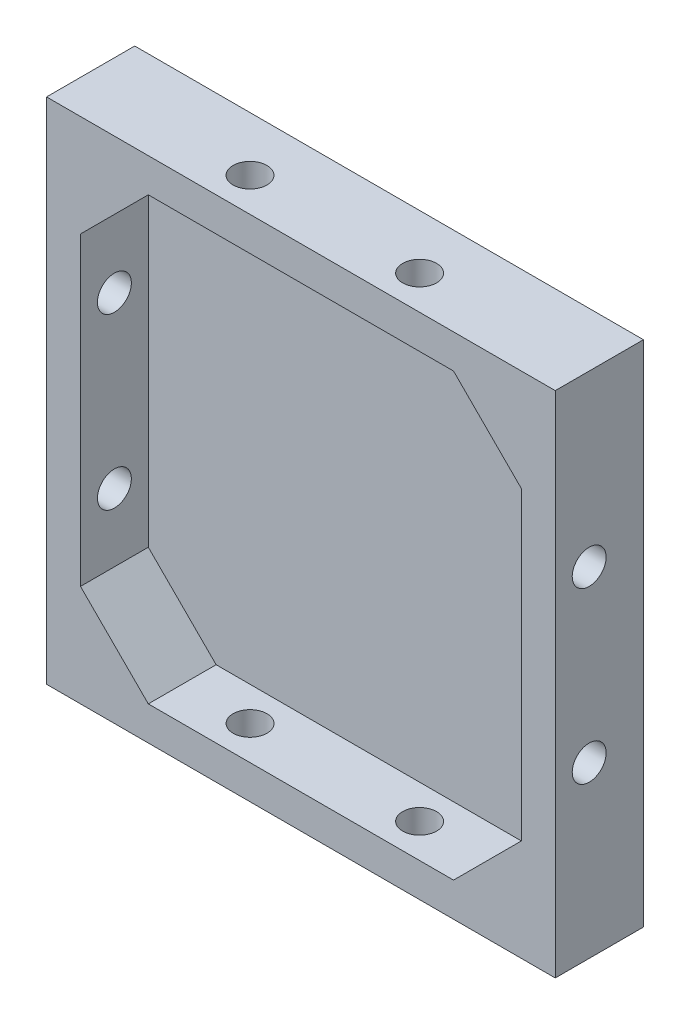
ISO-10303-21;
HEADER;
FILE_DESCRIPTION(('STEP AP214'),'2;1');
FILE_NAME('part.step','',(''),(''),'','','');
FILE_SCHEMA(('AUTOMOTIVE_DESIGN { 1 0 10303 214 1 1 1 1 }'));
ENDSEC;
DATA;
#1=APPLICATION_CONTEXT('core data for automotive mechanical design processes');
#2=APPLICATION_PROTOCOL_DEFINITION('international standard','automotive_design',2000,#1);
#3=PRODUCT_CONTEXT('',#1,'mechanical');
#4=PRODUCT('Part','Part','',(#3));
#5=PRODUCT_RELATED_PRODUCT_CATEGORY('part','',(#4));
#6=PRODUCT_DEFINITION_FORMATION('','',#4);
#7=PRODUCT_DEFINITION_CONTEXT('part definition',#1,'design');
#8=PRODUCT_DEFINITION('design','',#6,#7);
#9=PRODUCT_DEFINITION_SHAPE('','',#8);
#10=(LENGTH_UNIT() NAMED_UNIT(*) SI_UNIT(.MILLI.,.METRE.));
#11=(NAMED_UNIT(*) PLANE_ANGLE_UNIT() SI_UNIT($,.RADIAN.));
#12=(NAMED_UNIT(*) SI_UNIT($,.STERADIAN.) SOLID_ANGLE_UNIT());
#13=UNCERTAINTY_MEASURE_WITH_UNIT(LENGTH_MEASURE(1.E-05),#10,'distance_accuracy_value','');
#14=(GEOMETRIC_REPRESENTATION_CONTEXT(3) GLOBAL_UNCERTAINTY_ASSIGNED_CONTEXT((#13)) GLOBAL_UNIT_ASSIGNED_CONTEXT((#10,
#11,#12)) REPRESENTATION_CONTEXT('',''));
#15=CARTESIAN_POINT('',(0.,0.,0.));
#16=DIRECTION('',(0.,0.,1.));
#17=DIRECTION('',(1.,0.,0.));
#18=AXIS2_PLACEMENT_3D('',#15,#16,#17);
#19=CARTESIAN_POINT('',(0.,0.,3.));
#20=DIRECTION('',(0.,0.,1.));
#21=DIRECTION('',(1.,0.,0.));
#22=AXIS2_PLACEMENT_3D('',#19,#20,#21);
#23=PLANE('',#22);
#24=DIRECTION('',(0.,-1.,0.));
#25=VECTOR('',#24,1.);
#26=CARTESIAN_POINT('',(-15.8815636921236,33.7284482758621,3.));
#27=LINE('',#26,#25);
#28=CARTESIAN_POINT('',(-15.8815636921236,18.7284482758621,3.));
#29=VERTEX_POINT('',#28);
#30=CARTESIAN_POINT('',(-15.8815636921236,-26.2715517241379,3.));
#31=VERTEX_POINT('',#30);
#32=EDGE_CURVE('E141',#29,#31,#27,.T.);
#33=ORIENTED_EDGE('',*,*,#32,.T.);
#34=DIRECTION('',(-0.707106781186548,0.707106781186547,0.));
#35=VECTOR('',#34,1.);
#36=CARTESIAN_POINT('',(-5.88156369212356,-36.2715517241379,3.));
#37=LINE('',#36,#35);
#38=CARTESIAN_POINT('',(-5.88156369212356,-36.2715517241379,3.));
#39=VERTEX_POINT('',#38);
#40=EDGE_CURVE('E50',#39,#31,#37,.T.);
#41=ORIENTED_EDGE('',*,*,#40,.F.);
#42=DIRECTION('',(1.,0.,0.));
#43=VECTOR('',#42,1.);
#44=CARTESIAN_POINT('',(-20.8815636921236,-36.2715517241379,3.));
#45=LINE('',#44,#43);
#46=CARTESIAN_POINT('',(39.1184363078764,-36.2715517241379,3.));
#47=VERTEX_POINT('',#46);
#48=EDGE_CURVE('E231',#39,#47,#45,.T.);
#49=ORIENTED_EDGE('',*,*,#48,.T.);
#50=DIRECTION('',(-0.707106781186548,-0.707106781186548,0.));
#51=VECTOR('',#50,1.);
#52=CARTESIAN_POINT('',(49.1184363078764,-26.2715517241379,3.));
#53=LINE('',#52,#51);
#54=CARTESIAN_POINT('',(49.1184363078764,-26.2715517241379,3.));
#55=VERTEX_POINT('',#54);
#56=EDGE_CURVE('E238',#55,#47,#53,.T.);
#57=ORIENTED_EDGE('',*,*,#56,.F.);
#58=DIRECTION('',(0.,1.,0.));
#59=VECTOR('',#58,1.);
#60=CARTESIAN_POINT('',(49.1184363078764,33.7284482758621,3.));
#61=LINE('',#60,#59);
#62=CARTESIAN_POINT('',(49.1184363078764,18.7284482758621,3.));
#63=VERTEX_POINT('',#62);
#64=EDGE_CURVE('E154',#55,#63,#61,.T.);
#65=ORIENTED_EDGE('',*,*,#64,.T.);
#66=DIRECTION('',(0.707106781186548,-0.707106781186547,0.));
#67=VECTOR('',#66,1.);
#68=CARTESIAN_POINT('',(49.1184363078764,18.7284482758621,3.));
#69=LINE('',#68,#67);
#70=CARTESIAN_POINT('',(39.1184363078764,28.7284482758621,3.));
#71=VERTEX_POINT('',#70);
#72=EDGE_CURVE('E235',#71,#63,#69,.T.);
#73=ORIENTED_EDGE('',*,*,#72,.F.);
#74=DIRECTION('',(-1.,0.,0.));
#75=VECTOR('',#74,1.);
#76=CARTESIAN_POINT('',(-20.8815636921236,28.7284482758621,3.));
#77=LINE('',#76,#75);
#78=CARTESIAN_POINT('',(-5.88156369212357,28.7284482758621,3.));
#79=VERTEX_POINT('',#78);
#80=EDGE_CURVE('E150',#71,#79,#77,.T.);
#81=ORIENTED_EDGE('',*,*,#80,.T.);
#82=DIRECTION('',(0.707106781186548,0.707106781186548,0.));
#83=VECTOR('',#82,1.);
#84=CARTESIAN_POINT('',(-5.88156369212357,28.7284482758621,3.));
#85=LINE('',#84,#83);
#86=EDGE_CURVE('E137',#29,#79,#85,.T.);
#87=ORIENTED_EDGE('',*,*,#86,.F.);
#88=EDGE_LOOP('',(#33,#41,#49,#57,#65,#73,#81,#87));
#89=FACE_BOUND('',#88,.T.);
#90=ADVANCED_FACE('F33',(#89),#23,.T.);
#91=CARTESIAN_POINT('',(-20.8815636921236,-36.2715517241379,13.));
#92=DIRECTION('',(0.,1.,0.));
#93=DIRECTION('',(0.,0.,1.));
#94=AXIS2_PLACEMENT_3D('',#91,#92,#93);
#95=PLANE('',#94);
#96=CARTESIAN_POINT('',(29.1184363078764,-36.2715517241379,8.));
#97=DIRECTION('',(0.,1.,0.));
#98=DIRECTION('',(0.,0.,1.));
#99=AXIS2_PLACEMENT_3D('',#96,#97,#98);
#100=CIRCLE('',#99,2.5);
#101=CARTESIAN_POINT('',(29.1184363078764,-36.2715517241379,10.5));
#102=VERTEX_POINT('',#101);
#103=EDGE_CURVE('E213',#102,#102,#100,.T.);
#104=ORIENTED_EDGE('',*,*,#103,.F.);
#105=EDGE_LOOP('',(#104));
#106=FACE_BOUND('',#105,.T.);
#107=CARTESIAN_POINT('',(4.11843630787645,-36.2715517241379,8.));
#108=DIRECTION('',(0.,1.,0.));
#109=DIRECTION('',(0.,0.,1.));
#110=AXIS2_PLACEMENT_3D('',#107,#108,#109);
#111=CIRCLE('',#110,2.5);
#112=CARTESIAN_POINT('',(4.11843630787645,-36.2715517241379,10.5));
#113=VERTEX_POINT('',#112);
#114=EDGE_CURVE('E200',#113,#113,#111,.T.);
#115=ORIENTED_EDGE('',*,*,#114,.F.);
#116=EDGE_LOOP('',(#115));
#117=FACE_BOUND('',#116,.T.);
#118=ORIENTED_EDGE('',*,*,#48,.F.);
#119=DIRECTION('',(0.,0.,-1.));
#120=VECTOR('',#119,1.);
#121=CARTESIAN_POINT('',(-5.88156369212356,-36.2715517241379,27.142135623731));
#122=LINE('',#121,#120);
#123=CARTESIAN_POINT('',(-5.88156369212355,-36.2715517241379,13.));
#124=VERTEX_POINT('',#123);
#125=EDGE_CURVE('E284',#124,#39,#122,.T.);
#126=ORIENTED_EDGE('',*,*,#125,.F.);
#127=DIRECTION('',(1.,0.,0.));
#128=VECTOR('',#127,1.);
#129=CARTESIAN_POINT('',(-20.8815636921236,-36.2715517241379,13.));
#130=LINE('',#129,#128);
#131=CARTESIAN_POINT('',(39.1184363078764,-36.2715517241379,13.));
#132=VERTEX_POINT('',#131);
#133=EDGE_CURVE('E149',#124,#132,#130,.T.);
#134=ORIENTED_EDGE('',*,*,#133,.T.);
#135=DIRECTION('',(0.,0.,-1.));
#136=VECTOR('',#135,1.);
#137=CARTESIAN_POINT('',(39.1184363078764,-36.2715517241379,27.142135623731));
#138=LINE('',#137,#136);
#139=EDGE_CURVE('E258',#132,#47,#138,.T.);
#140=ORIENTED_EDGE('',*,*,#139,.T.);
#141=EDGE_LOOP('',(#118,#126,#134,#140));
#142=FACE_BOUND('',#141,.T.);
#143=ADVANCED_FACE('F298',(#106,#117,#142),#95,.T.);
#144=CARTESIAN_POINT('',(-15.8815636921236,33.7284482758621,13.));
#145=DIRECTION('',(1.,0.,0.));
#146=DIRECTION('',(0.,1.,0.));
#147=AXIS2_PLACEMENT_3D('',#144,#145,#146);
#148=PLANE('',#147);
#149=CARTESIAN_POINT('',(-15.8815636921236,8.72844827586207,8.));
#150=DIRECTION('',(1.,0.,0.));
#151=DIRECTION('',(0.,1.,0.));
#152=AXIS2_PLACEMENT_3D('',#149,#150,#151);
#153=CIRCLE('',#152,2.5);
#154=CARTESIAN_POINT('',(-15.8815636921236,11.2284482758621,8.));
#155=VERTEX_POINT('',#154);
#156=EDGE_CURVE('E196',#155,#155,#153,.T.);
#157=ORIENTED_EDGE('',*,*,#156,.F.);
#158=EDGE_LOOP('',(#157));
#159=FACE_BOUND('',#158,.T.);
#160=CARTESIAN_POINT('',(-15.8815636921236,-16.2715517241379,8.));
#161=DIRECTION('',(1.,0.,0.));
#162=DIRECTION('',(0.,1.,0.));
#163=AXIS2_PLACEMENT_3D('',#160,#161,#162);
#164=CIRCLE('',#163,2.5);
#165=CARTESIAN_POINT('',(-15.8815636921236,-13.7715517241379,8.));
#166=VERTEX_POINT('',#165);
#167=EDGE_CURVE('E192',#166,#166,#164,.T.);
#168=ORIENTED_EDGE('',*,*,#167,.F.);
#169=EDGE_LOOP('',(#168));
#170=FACE_BOUND('',#169,.T.);
#171=DIRECTION('',(0.,-1.,0.));
#172=VECTOR('',#171,1.);
#173=CARTESIAN_POINT('',(-15.8815636921236,33.7284482758621,13.));
#174=LINE('',#173,#172);
#175=CARTESIAN_POINT('',(-15.8815636921236,18.7284482758621,13.));
#176=VERTEX_POINT('',#175);
#177=CARTESIAN_POINT('',(-15.8815636921236,-26.2715517241379,13.));
#178=VERTEX_POINT('',#177);
#179=EDGE_CURVE('E140',#176,#178,#174,.T.);
#180=ORIENTED_EDGE('',*,*,#179,.T.);
#181=DIRECTION('',(0.,0.,-1.));
#182=VECTOR('',#181,1.);
#183=CARTESIAN_POINT('',(-15.8815636921236,-26.2715517241379,27.142135623731));
#184=LINE('',#183,#182);
#185=EDGE_CURVE('E58',#178,#31,#184,.T.);
#186=ORIENTED_EDGE('',*,*,#185,.T.);
#187=ORIENTED_EDGE('',*,*,#32,.F.);
#188=DIRECTION('',(0.,0.,-1.));
#189=VECTOR('',#188,1.);
#190=CARTESIAN_POINT('',(-15.8815636921236,18.7284482758621,27.142135623731));
#191=LINE('',#190,#189);
#192=EDGE_CURVE('E129',#176,#29,#191,.T.);
#193=ORIENTED_EDGE('',*,*,#192,.F.);
#194=EDGE_LOOP('',(#180,#186,#187,#193));
#195=FACE_BOUND('',#194,.T.);
#196=ADVANCED_FACE('F139',(#159,#170,#195),#148,.T.);
#197=CARTESIAN_POINT('',(49.1184363078764,33.7284482758621,13.));
#198=DIRECTION('',(-1.,0.,0.));
#199=DIRECTION('',(0.,0.,1.));
#200=AXIS2_PLACEMENT_3D('',#197,#198,#199);
#201=PLANE('',#200);
#202=CARTESIAN_POINT('',(49.1184363078764,8.72844827586207,8.));
#203=DIRECTION('',(-1.,0.,0.));
#204=DIRECTION('',(0.,0.,1.));
#205=AXIS2_PLACEMENT_3D('',#202,#203,#204);
#206=CIRCLE('',#205,2.5);
#207=CARTESIAN_POINT('',(49.1184363078764,6.22844827586207,8.));
#208=VERTEX_POINT('',#207);
#209=EDGE_CURVE('E194',#208,#208,#206,.T.);
#210=ORIENTED_EDGE('',*,*,#209,.F.);
#211=EDGE_LOOP('',(#210));
#212=FACE_BOUND('',#211,.T.);
#213=CARTESIAN_POINT('',(49.1184363078764,-16.2715517241379,8.));
#214=DIRECTION('',(-1.,0.,0.));
#215=DIRECTION('',(0.,0.,1.));
#216=AXIS2_PLACEMENT_3D('',#213,#214,#215);
#217=CIRCLE('',#216,2.5);
#218=CARTESIAN_POINT('',(49.1184363078764,-18.7715517241379,8.));
#219=VERTEX_POINT('',#218);
#220=EDGE_CURVE('E189',#219,#219,#217,.T.);
#221=ORIENTED_EDGE('',*,*,#220,.F.);
#222=EDGE_LOOP('',(#221));
#223=FACE_BOUND('',#222,.T.);
#224=ORIENTED_EDGE('',*,*,#64,.F.);
#225=DIRECTION('',(0.,0.,-1.));
#226=VECTOR('',#225,1.);
#227=CARTESIAN_POINT('',(49.1184363078764,-26.2715517241379,27.142135623731));
#228=LINE('',#227,#226);
#229=CARTESIAN_POINT('',(49.1184363078764,-26.2715517241379,13.));
#230=VERTEX_POINT('',#229);
#231=EDGE_CURVE('E291',#230,#55,#228,.T.);
#232=ORIENTED_EDGE('',*,*,#231,.F.);
#233=DIRECTION('',(0.,1.,0.));
#234=VECTOR('',#233,1.);
#235=CARTESIAN_POINT('',(49.1184363078764,33.7284482758621,13.));
#236=LINE('',#235,#234);
#237=CARTESIAN_POINT('',(49.1184363078764,18.7284482758621,13.));
#238=VERTEX_POINT('',#237);
#239=EDGE_CURVE('E152',#230,#238,#236,.T.);
#240=ORIENTED_EDGE('',*,*,#239,.T.);
#241=DIRECTION('',(0.,0.,-1.));
#242=VECTOR('',#241,1.);
#243=CARTESIAN_POINT('',(49.1184363078764,18.7284482758621,27.142135623731));
#244=LINE('',#243,#242);
#245=EDGE_CURVE('E242',#238,#63,#244,.T.);
#246=ORIENTED_EDGE('',*,*,#245,.T.);
#247=EDGE_LOOP('',(#224,#232,#240,#246));
#248=FACE_BOUND('',#247,.T.);
#249=ADVANCED_FACE('F243',(#212,#223,#248),#201,.T.);
#250=CARTESIAN_POINT('',(-20.8815636921236,28.7284482758621,13.));
#251=DIRECTION('',(0.,-1.,0.));
#252=DIRECTION('',(0.,0.,-1.));
#253=AXIS2_PLACEMENT_3D('',#250,#251,#252);
#254=PLANE('',#253);
#255=CARTESIAN_POINT('',(29.1184363078764,28.7284482758621,8.));
#256=DIRECTION('',(0.,-1.,0.));
#257=DIRECTION('',(0.,0.,-1.));
#258=AXIS2_PLACEMENT_3D('',#255,#256,#257);
#259=CIRCLE('',#258,2.5);
#260=CARTESIAN_POINT('',(29.1184363078764,28.7284482758621,5.5));
#261=VERTEX_POINT('',#260);
#262=EDGE_CURVE('E37',#261,#261,#259,.T.);
#263=ORIENTED_EDGE('',*,*,#262,.F.);
#264=EDGE_LOOP('',(#263));
#265=FACE_BOUND('',#264,.T.);
#266=CARTESIAN_POINT('',(4.11843630787645,28.7284482758621,8.));
#267=DIRECTION('',(0.,-1.,0.));
#268=DIRECTION('',(0.,0.,-1.));
#269=AXIS2_PLACEMENT_3D('',#266,#267,#268);
#270=CIRCLE('',#269,2.5);
#271=CARTESIAN_POINT('',(4.11843630787645,28.7284482758621,5.5));
#272=VERTEX_POINT('',#271);
#273=EDGE_CURVE('E198',#272,#272,#270,.T.);
#274=ORIENTED_EDGE('',*,*,#273,.F.);
#275=EDGE_LOOP('',(#274));
#276=FACE_BOUND('',#275,.T.);
#277=ORIENTED_EDGE('',*,*,#80,.F.);
#278=DIRECTION('',(0.,0.,-1.));
#279=VECTOR('',#278,1.);
#280=CARTESIAN_POINT('',(39.1184363078764,28.7284482758621,27.142135623731));
#281=LINE('',#280,#279);
#282=CARTESIAN_POINT('',(39.1184363078764,28.7284482758621,13.));
#283=VERTEX_POINT('',#282);
#284=EDGE_CURVE('E252',#283,#71,#281,.T.);
#285=ORIENTED_EDGE('',*,*,#284,.F.);
#286=DIRECTION('',(-1.,0.,0.));
#287=VECTOR('',#286,1.);
#288=CARTESIAN_POINT('',(-20.8815636921236,28.7284482758621,13.));
#289=LINE('',#288,#287);
#290=CARTESIAN_POINT('',(-5.88156369212357,28.7284482758621,13.));
#291=VERTEX_POINT('',#290);
#292=EDGE_CURVE('E159',#283,#291,#289,.T.);
#293=ORIENTED_EDGE('',*,*,#292,.T.);
#294=DIRECTION('',(0.,0.,-1.));
#295=VECTOR('',#294,1.);
#296=CARTESIAN_POINT('',(-5.88156369212357,28.7284482758621,27.142135623731));
#297=LINE('',#296,#295);
#298=EDGE_CURVE('E132',#291,#79,#297,.T.);
#299=ORIENTED_EDGE('',*,*,#298,.T.);
#300=EDGE_LOOP('',(#277,#285,#293,#299));
#301=FACE_BOUND('',#300,.T.);
#302=ADVANCED_FACE('F276',(#265,#276,#301),#254,.T.);
#303=CARTESIAN_POINT('',(-20.8815636921236,33.7284482758621,13.));
#304=DIRECTION('',(1.,0.,0.));
#305=DIRECTION('',(0.,1.,0.));
#306=AXIS2_PLACEMENT_3D('',#303,#304,#305);
#307=PLANE('',#306);
#308=CARTESIAN_POINT('',(-20.8815636921236,8.72844827586207,8.));
#309=DIRECTION('',(-1.,0.,0.));
#310=DIRECTION('',(0.,-1.,0.));
#311=AXIS2_PLACEMENT_3D('',#308,#309,#310);
#312=CIRCLE('',#311,2.5);
#313=CARTESIAN_POINT('',(-20.8815636921236,6.22844827586206,8.));
#314=VERTEX_POINT('',#313);
#315=EDGE_CURVE('E197',#314,#314,#312,.T.);
#316=ORIENTED_EDGE('',*,*,#315,.F.);
#317=EDGE_LOOP('',(#316));
#318=FACE_BOUND('',#317,.T.);
#319=CARTESIAN_POINT('',(-20.8815636921236,-16.2715517241379,8.));
#320=DIRECTION('',(-1.,0.,0.));
#321=DIRECTION('',(0.,-1.,0.));
#322=AXIS2_PLACEMENT_3D('',#319,#320,#321);
#323=CIRCLE('',#322,2.5);
#324=CARTESIAN_POINT('',(-20.8815636921236,-18.7715517241379,8.));
#325=VERTEX_POINT('',#324);
#326=EDGE_CURVE('E223',#325,#325,#323,.T.);
#327=ORIENTED_EDGE('',*,*,#326,.F.);
#328=EDGE_LOOP('',(#327));
#329=FACE_BOUND('',#328,.T.);
#330=DIRECTION('',(0.,-1.,0.));
#331=VECTOR('',#330,1.);
#332=CARTESIAN_POINT('',(-20.8815636921236,33.7284482758621,0.));
#333=LINE('',#332,#331);
#334=CARTESIAN_POINT('',(-20.8815636921236,33.7284482758621,0.));
#335=VERTEX_POINT('',#334);
#336=CARTESIAN_POINT('',(-20.8815636921236,-41.2715517241379,0.));
#337=VERTEX_POINT('',#336);
#338=EDGE_CURVE('E161',#335,#337,#333,.T.);
#339=ORIENTED_EDGE('',*,*,#338,.T.);
#340=DIRECTION('',(0.,0.,-1.));
#341=VECTOR('',#340,1.);
#342=CARTESIAN_POINT('',(-20.8815636921236,-41.2715517241379,13.));
#343=LINE('',#342,#341);
#344=CARTESIAN_POINT('',(-20.8815636921236,-41.2715517241379,13.));
#345=VERTEX_POINT('',#344);
#346=EDGE_CURVE('E11',#345,#337,#343,.T.);
#347=ORIENTED_EDGE('',*,*,#346,.F.);
#348=DIRECTION('',(0.,-1.,0.));
#349=VECTOR('',#348,1.);
#350=CARTESIAN_POINT('',(-20.8815636921236,33.7284482758621,13.));
#351=LINE('',#350,#349);
#352=CARTESIAN_POINT('',(-20.8815636921236,33.7284482758621,13.));
#353=VERTEX_POINT('',#352);
#354=EDGE_CURVE('E162',#353,#345,#351,.T.);
#355=ORIENTED_EDGE('',*,*,#354,.F.);
#356=DIRECTION('',(0.,0.,-1.));
#357=VECTOR('',#356,1.);
#358=CARTESIAN_POINT('',(-20.8815636921236,33.7284482758621,13.));
#359=LINE('',#358,#357);
#360=EDGE_CURVE('E172',#353,#335,#359,.T.);
#361=ORIENTED_EDGE('',*,*,#360,.T.);
#362=EDGE_LOOP('',(#339,#347,#355,#361));
#363=FACE_BOUND('',#362,.T.);
#364=ADVANCED_FACE('F35',(#318,#329,#363),#307,.F.);
#365=CARTESIAN_POINT('',(-20.8815636921236,-41.2715517241379,13.));
#366=DIRECTION('',(0.,1.,0.));
#367=DIRECTION('',(0.,0.,1.));
#368=AXIS2_PLACEMENT_3D('',#365,#366,#367);
#369=PLANE('',#368);
#370=CARTESIAN_POINT('',(29.1184363078764,-41.2715517241379,8.));
#371=DIRECTION('',(0.,-1.,0.));
#372=DIRECTION('',(0.,0.,-1.));
#373=AXIS2_PLACEMENT_3D('',#370,#371,#372);
#374=CIRCLE('',#373,2.5);
#375=CARTESIAN_POINT('',(29.1184363078764,-41.2715517241379,5.5));
#376=VERTEX_POINT('',#375);
#377=EDGE_CURVE('E136',#376,#376,#374,.T.);
#378=ORIENTED_EDGE('',*,*,#377,.F.);
#379=EDGE_LOOP('',(#378));
#380=FACE_BOUND('',#379,.T.);
#381=CARTESIAN_POINT('',(4.11843630787645,-41.2715517241379,8.));
#382=DIRECTION('',(0.,-1.,0.));
#383=DIRECTION('',(0.,0.,-1.));
#384=AXIS2_PLACEMENT_3D('',#381,#382,#383);
#385=CIRCLE('',#384,2.5);
#386=CARTESIAN_POINT('',(4.11843630787645,-41.2715517241379,5.5));
#387=VERTEX_POINT('',#386);
#388=EDGE_CURVE('E208',#387,#387,#385,.T.);
#389=ORIENTED_EDGE('',*,*,#388,.F.);
#390=EDGE_LOOP('',(#389));
#391=FACE_BOUND('',#390,.T.);
#392=DIRECTION('',(1.,0.,0.));
#393=VECTOR('',#392,1.);
#394=CARTESIAN_POINT('',(-20.8815636921236,-41.2715517241379,0.));
#395=LINE('',#394,#393);
#396=CARTESIAN_POINT('',(54.1184363078764,-41.2715517241379,0.));
#397=VERTEX_POINT('',#396);
#398=EDGE_CURVE('E175',#337,#397,#395,.T.);
#399=ORIENTED_EDGE('',*,*,#398,.T.);
#400=DIRECTION('',(0.,0.,-1.));
#401=VECTOR('',#400,1.);
#402=CARTESIAN_POINT('',(54.1184363078764,-41.2715517241379,13.));
#403=LINE('',#402,#401);
#404=CARTESIAN_POINT('',(54.1184363078764,-41.2715517241379,13.));
#405=VERTEX_POINT('',#404);
#406=EDGE_CURVE('E42',#405,#397,#403,.T.);
#407=ORIENTED_EDGE('',*,*,#406,.F.);
#408=DIRECTION('',(1.,0.,0.));
#409=VECTOR('',#408,1.);
#410=CARTESIAN_POINT('',(-20.8815636921236,-41.2715517241379,13.));
#411=LINE('',#410,#409);
#412=EDGE_CURVE('E165',#345,#405,#411,.T.);
#413=ORIENTED_EDGE('',*,*,#412,.F.);
#414=ORIENTED_EDGE('',*,*,#346,.T.);
#415=EDGE_LOOP('',(#399,#407,#413,#414));
#416=FACE_BOUND('',#415,.T.);
#417=ADVANCED_FACE('F330',(#380,#391,#416),#369,.F.);
#418=CARTESIAN_POINT('',(54.1184363078764,33.7284482758621,13.));
#419=DIRECTION('',(-1.,0.,0.));
#420=DIRECTION('',(0.,0.,1.));
#421=AXIS2_PLACEMENT_3D('',#418,#419,#420);
#422=PLANE('',#421);
#423=CARTESIAN_POINT('',(54.1184363078764,8.72844827586207,8.));
#424=DIRECTION('',(-1.,0.,0.));
#425=DIRECTION('',(0.,0.,1.));
#426=AXIS2_PLACEMENT_3D('',#423,#424,#425);
#427=CIRCLE('',#426,2.5);
#428=CARTESIAN_POINT('',(54.1184363078764,6.22844827586207,8.));
#429=VERTEX_POINT('',#428);
#430=EDGE_CURVE('E205',#429,#429,#427,.F.);
#431=ORIENTED_EDGE('',*,*,#430,.F.);
#432=EDGE_LOOP('',(#431));
#433=FACE_BOUND('',#432,.T.);
#434=CARTESIAN_POINT('',(54.1184363078764,-16.2715517241379,8.));
#435=DIRECTION('',(-1.,0.,0.));
#436=DIRECTION('',(0.,0.,1.));
#437=AXIS2_PLACEMENT_3D('',#434,#435,#436);
#438=CIRCLE('',#437,2.5);
#439=CARTESIAN_POINT('',(54.1184363078764,-18.7715517241379,8.));
#440=VERTEX_POINT('',#439);
#441=EDGE_CURVE('E193',#440,#440,#438,.F.);
#442=ORIENTED_EDGE('',*,*,#441,.F.);
#443=EDGE_LOOP('',(#442));
#444=FACE_BOUND('',#443,.T.);
#445=DIRECTION('',(0.,1.,0.));
#446=VECTOR('',#445,1.);
#447=CARTESIAN_POINT('',(54.1184363078764,33.7284482758621,0.));
#448=LINE('',#447,#446);
#449=CARTESIAN_POINT('',(54.1184363078764,33.7284482758621,0.));
#450=VERTEX_POINT('',#449);
#451=EDGE_CURVE('E178',#397,#450,#448,.T.);
#452=ORIENTED_EDGE('',*,*,#451,.T.);
#453=DIRECTION('',(0.,0.,-1.));
#454=VECTOR('',#453,1.);
#455=CARTESIAN_POINT('',(54.1184363078764,33.7284482758621,13.));
#456=LINE('',#455,#454);
#457=CARTESIAN_POINT('',(54.1184363078764,33.7284482758621,13.));
#458=VERTEX_POINT('',#457);
#459=EDGE_CURVE('E184',#458,#450,#456,.T.);
#460=ORIENTED_EDGE('',*,*,#459,.F.);
#461=DIRECTION('',(0.,1.,0.));
#462=VECTOR('',#461,1.);
#463=CARTESIAN_POINT('',(54.1184363078764,23.728448275862,13.));
#464=LINE('',#463,#462);
#465=EDGE_CURVE('E168',#405,#458,#464,.T.);
#466=ORIENTED_EDGE('',*,*,#465,.F.);
#467=ORIENTED_EDGE('',*,*,#406,.T.);
#468=EDGE_LOOP('',(#452,#460,#466,#467));
#469=FACE_BOUND('',#468,.T.);
#470=ADVANCED_FACE('F327',(#433,#444,#469),#422,.F.);
#471=CARTESIAN_POINT('',(-20.8815636921236,33.7284482758621,13.));
#472=DIRECTION('',(0.,-1.,0.));
#473=DIRECTION('',(0.,0.,-1.));
#474=AXIS2_PLACEMENT_3D('',#471,#472,#473);
#475=PLANE('',#474);
#476=CARTESIAN_POINT('',(29.1184363078764,33.7284482758621,8.));
#477=DIRECTION('',(0.,-1.,0.));
#478=DIRECTION('',(0.,0.,-1.));
#479=AXIS2_PLACEMENT_3D('',#476,#477,#478);
#480=CIRCLE('',#479,2.5);
#481=CARTESIAN_POINT('',(29.1184363078764,33.7284482758621,5.5));
#482=VERTEX_POINT('',#481);
#483=EDGE_CURVE('E265',#482,#482,#480,.F.);
#484=ORIENTED_EDGE('',*,*,#483,.F.);
#485=EDGE_LOOP('',(#484));
#486=FACE_BOUND('',#485,.T.);
#487=CARTESIAN_POINT('',(4.11843630787645,33.7284482758621,8.));
#488=DIRECTION('',(0.,-1.,0.));
#489=DIRECTION('',(0.,0.,-1.));
#490=AXIS2_PLACEMENT_3D('',#487,#488,#489);
#491=CIRCLE('',#490,2.5);
#492=CARTESIAN_POINT('',(4.11843630787645,33.7284482758621,5.5));
#493=VERTEX_POINT('',#492);
#494=EDGE_CURVE('E201',#493,#493,#491,.F.);
#495=ORIENTED_EDGE('',*,*,#494,.F.);
#496=EDGE_LOOP('',(#495));
#497=FACE_BOUND('',#496,.T.);
#498=DIRECTION('',(-1.,0.,0.));
#499=VECTOR('',#498,1.);
#500=CARTESIAN_POINT('',(-20.8815636921236,33.7284482758621,0.));
#501=LINE('',#500,#499);
#502=EDGE_CURVE('E166',#450,#335,#501,.T.);
#503=ORIENTED_EDGE('',*,*,#502,.T.);
#504=ORIENTED_EDGE('',*,*,#360,.F.);
#505=DIRECTION('',(-1.,0.,0.));
#506=VECTOR('',#505,1.);
#507=CARTESIAN_POINT('',(44.1184363078764,33.7284482758621,13.));
#508=LINE('',#507,#506);
#509=EDGE_CURVE('E170',#458,#353,#508,.T.);
#510=ORIENTED_EDGE('',*,*,#509,.F.);
#511=ORIENTED_EDGE('',*,*,#459,.T.);
#512=EDGE_LOOP('',(#503,#504,#510,#511));
#513=FACE_BOUND('',#512,.T.);
#514=ADVANCED_FACE('F320',(#486,#497,#513),#475,.F.);
#515=CARTESIAN_POINT('',(0.,0.,13.));
#516=DIRECTION('',(0.,0.,1.));
#517=DIRECTION('',(1.,0.,0.));
#518=AXIS2_PLACEMENT_3D('',#515,#516,#517);
#519=PLANE('',#518);
#520=ORIENTED_EDGE('',*,*,#133,.F.);
#521=DIRECTION('',(-0.707106781186548,0.707106781186547,0.));
#522=VECTOR('',#521,1.);
#523=CARTESIAN_POINT('',(-5.88156369212356,-36.2715517241379,13.));
#524=LINE('',#523,#522);
#525=EDGE_CURVE('E148',#124,#178,#524,.T.);
#526=ORIENTED_EDGE('',*,*,#525,.T.);
#527=ORIENTED_EDGE('',*,*,#179,.F.);
#528=DIRECTION('',(0.707106781186548,0.707106781186548,0.));
#529=VECTOR('',#528,1.);
#530=CARTESIAN_POINT('',(-5.88156369212357,28.7284482758621,13.));
#531=LINE('',#530,#529);
#532=EDGE_CURVE('E125',#176,#291,#531,.T.);
#533=ORIENTED_EDGE('',*,*,#532,.T.);
#534=ORIENTED_EDGE('',*,*,#292,.F.);
#535=DIRECTION('',(0.707106781186548,-0.707106781186547,0.));
#536=VECTOR('',#535,1.);
#537=CARTESIAN_POINT('',(49.1184363078764,18.7284482758621,13.));
#538=LINE('',#537,#536);
#539=EDGE_CURVE('E248',#283,#238,#538,.T.);
#540=ORIENTED_EDGE('',*,*,#539,.T.);
#541=ORIENTED_EDGE('',*,*,#239,.F.);
#542=DIRECTION('',(-0.707106781186548,-0.707106781186548,0.));
#543=VECTOR('',#542,1.);
#544=CARTESIAN_POINT('',(49.1184363078764,-26.2715517241379,13.));
#545=LINE('',#544,#543);
#546=EDGE_CURVE('E254',#230,#132,#545,.T.);
#547=ORIENTED_EDGE('',*,*,#546,.T.);
#548=EDGE_LOOP('',(#520,#526,#527,#533,#534,#540,#541,#547));
#549=FACE_BOUND('',#548,.T.);
#550=ORIENTED_EDGE('',*,*,#354,.T.);
#551=ORIENTED_EDGE('',*,*,#412,.T.);
#552=ORIENTED_EDGE('',*,*,#465,.T.);
#553=ORIENTED_EDGE('',*,*,#509,.T.);
#554=EDGE_LOOP('',(#550,#551,#552,#553));
#555=FACE_BOUND('',#554,.T.);
#556=ADVANCED_FACE('F145',(#549,#555),#519,.T.);
#557=CARTESIAN_POINT('',(0.,0.,0.));
#558=DIRECTION('',(0.,0.,1.));
#559=DIRECTION('',(1.,0.,0.));
#560=AXIS2_PLACEMENT_3D('',#557,#558,#559);
#561=PLANE('',#560);
#562=ORIENTED_EDGE('',*,*,#338,.F.);
#563=ORIENTED_EDGE('',*,*,#502,.F.);
#564=ORIENTED_EDGE('',*,*,#451,.F.);
#565=ORIENTED_EDGE('',*,*,#398,.F.);
#566=EDGE_LOOP('',(#562,#563,#564,#565));
#567=FACE_BOUND('',#566,.T.);
#568=ADVANCED_FACE('F319',(#567),#561,.F.);
#569=CARTESIAN_POINT('',(61.1895041197419,-16.2715517241379,8.));
#570=DIRECTION('',(-1.,0.,0.));
#571=DIRECTION('',(0.,-1.,0.));
#572=AXIS2_PLACEMENT_3D('',#569,#570,#571);
#573=CYLINDRICAL_SURFACE('',#572,2.5);
#574=CARTESIAN_POINT('',(49.1184363078764,-18.7715517241379,8.));
#575=CARTESIAN_POINT('',(49.1705196412098,-18.7715517241379,8.));
#576=CARTESIAN_POINT('',(49.2226029745431,-18.7715517241379,8.));
#577=CARTESIAN_POINT('',(49.3267696412098,-18.7715517241379,8.));
#578=CARTESIAN_POINT('',(49.3788529745431,-18.7715517241379,8.));
#579=CARTESIAN_POINT('',(49.4830196412098,-18.7715517241379,8.));
#580=CARTESIAN_POINT('',(49.5351029745431,-18.7715517241379,8.));
#581=CARTESIAN_POINT('',(49.6392696412098,-18.7715517241379,8.));
#582=CARTESIAN_POINT('',(49.6913529745431,-18.7715517241379,8.));
#583=CARTESIAN_POINT('',(49.7955196412098,-18.7715517241379,8.));
#584=CARTESIAN_POINT('',(49.8476029745431,-18.7715517241379,8.));
#585=CARTESIAN_POINT('',(49.9517696412098,-18.7715517241379,8.));
#586=CARTESIAN_POINT('',(50.0038529745431,-18.7715517241379,8.));
#587=CARTESIAN_POINT('',(50.1080196412098,-18.7715517241379,8.));
#588=CARTESIAN_POINT('',(50.1601029745431,-18.7715517241379,8.));
#589=CARTESIAN_POINT('',(50.2642696412098,-18.7715517241379,8.));
#590=CARTESIAN_POINT('',(50.3163529745431,-18.7715517241379,8.));
#591=CARTESIAN_POINT('',(50.4205196412098,-18.7715517241379,8.));
#592=CARTESIAN_POINT('',(50.4726029745431,-18.7715517241379,8.));
#593=CARTESIAN_POINT('',(50.5767696412098,-18.7715517241379,8.));
#594=CARTESIAN_POINT('',(50.6288529745431,-18.7715517241379,8.));
#595=CARTESIAN_POINT('',(50.7330196412098,-18.7715517241379,8.));
#596=CARTESIAN_POINT('',(50.7851029745431,-18.7715517241379,8.));
#597=CARTESIAN_POINT('',(50.8892696412098,-18.7715517241379,8.));
#598=CARTESIAN_POINT('',(50.9413529745431,-18.7715517241379,8.));
#599=CARTESIAN_POINT('',(51.0455196412098,-18.7715517241379,8.));
#600=CARTESIAN_POINT('',(51.0976029745431,-18.7715517241379,8.));
#601=CARTESIAN_POINT('',(51.2017696412098,-18.7715517241379,8.));
#602=CARTESIAN_POINT('',(51.2538529745431,-18.7715517241379,8.));
#603=CARTESIAN_POINT('',(51.3580196412098,-18.7715517241379,8.));
#604=CARTESIAN_POINT('',(51.4101029745431,-18.7715517241379,8.));
#605=CARTESIAN_POINT('',(51.5142696412098,-18.7715517241379,8.));
#606=CARTESIAN_POINT('',(51.5663529745431,-18.7715517241379,8.));
#607=CARTESIAN_POINT('',(51.6705196412098,-18.7715517241379,8.));
#608=CARTESIAN_POINT('',(51.7226029745431,-18.7715517241379,8.));
#609=CARTESIAN_POINT('',(51.8267696412098,-18.7715517241379,8.));
#610=CARTESIAN_POINT('',(51.8788529745431,-18.7715517241379,8.));
#611=CARTESIAN_POINT('',(51.9830196412098,-18.7715517241379,8.));
#612=CARTESIAN_POINT('',(52.0351029745431,-18.7715517241379,8.));
#613=CARTESIAN_POINT('',(52.1392696412098,-18.7715517241379,8.));
#614=CARTESIAN_POINT('',(52.1913529745431,-18.7715517241379,8.));
#615=CARTESIAN_POINT('',(52.2955196412098,-18.7715517241379,8.));
#616=CARTESIAN_POINT('',(52.3476029745431,-18.7715517241379,8.));
#617=CARTESIAN_POINT('',(52.4517696412098,-18.7715517241379,8.));
#618=CARTESIAN_POINT('',(52.5038529745431,-18.7715517241379,8.));
#619=CARTESIAN_POINT('',(52.6080196412098,-18.7715517241379,8.));
#620=CARTESIAN_POINT('',(52.6601029745431,-18.7715517241379,8.));
#621=CARTESIAN_POINT('',(52.7642696412098,-18.7715517241379,8.));
#622=CARTESIAN_POINT('',(52.8163529745431,-18.7715517241379,8.));
#623=CARTESIAN_POINT('',(52.9205196412098,-18.7715517241379,8.));
#624=CARTESIAN_POINT('',(52.9726029745431,-18.7715517241379,8.));
#625=CARTESIAN_POINT('',(53.0767696412098,-18.7715517241379,8.));
#626=CARTESIAN_POINT('',(53.1288529745431,-18.7715517241379,8.));
#627=CARTESIAN_POINT('',(53.2330196412098,-18.7715517241379,8.));
#628=CARTESIAN_POINT('',(53.2851029745431,-18.7715517241379,8.));
#629=CARTESIAN_POINT('',(53.3892696412098,-18.7715517241379,8.));
#630=CARTESIAN_POINT('',(53.4413529745431,-18.7715517241379,8.));
#631=CARTESIAN_POINT('',(53.5455196412098,-18.7715517241379,8.));
#632=CARTESIAN_POINT('',(53.5976029745431,-18.7715517241379,8.));
#633=CARTESIAN_POINT('',(53.7017696412098,-18.7715517241379,8.));
#634=CARTESIAN_POINT('',(53.7538529745431,-18.7715517241379,8.));
#635=CARTESIAN_POINT('',(53.8580196412098,-18.7715517241379,8.));
#636=CARTESIAN_POINT('',(53.9101029745431,-18.7715517241379,8.));
#637=CARTESIAN_POINT('',(54.0142696412098,-18.7715517241379,8.));
#638=CARTESIAN_POINT('',(54.0663529745431,-18.7715517241379,8.));
#639=CARTESIAN_POINT('',(54.1184363078764,-18.7715517241379,8.));
#640=B_SPLINE_CURVE_WITH_KNOTS('',3,(#574,#575,#576,#577,#578,#579,#580,#581,#582,#583,#584,
#585,#586,#587,#588,#589,#590,#591,#592,#593,#594,#595,#596,#597,#598,#599,#600,#601,#602,#603,
#604,#605,#606,#607,#608,#609,#610,#611,#612,#613,#614,#615,#616,#617,#618,#619,#620,#621,#622,
#623,#624,#625,#626,#627,#628,#629,#630,#631,#632,#633,#634,#635,#636,#637,#638,#639),
.UNSPECIFIED.,.F.,.F.,(4,2,2,2,2,2,2,2,2,2,2,2,2,2,2,2,2,2,2,2,2,2,2,2,2,2,2,2,2,2,2,2,4),(0.,
0.156250000000004,0.312500000000007,0.468750000000004,0.625000000000001,0.781250000000004,
0.937500000000001,1.09375,1.25,1.40625,1.5625,1.71875,1.875,2.03125,2.1875,2.34375000000001,2.5,
2.65625,2.8125,2.96875000000001,3.125,3.28125,3.4375,3.59375,3.75,3.90625,4.0625,4.21875,4.375,
4.53125,4.6875,4.84375,5.),.UNSPECIFIED.);
#641=EDGE_CURVE('BSEAM323',#219,#440,#640,.T.);
#642=ORIENTED_EDGE('',*,*,#220,.T.);
#643=ORIENTED_EDGE('',*,*,#441,.T.);
#644=ORIENTED_EDGE('',*,*,#641,.T.);
#645=ORIENTED_EDGE('',*,*,#641,.F.);
#646=EDGE_LOOP('',(#642,#644,#643,#645));
#647=FACE_BOUND('',#646,.T.);
#648=ADVANCED_FACE('F323',(#647),#573,.F.);
#649=ORIENTED_EDGE('',*,*,#167,.T.);
#650=EDGE_LOOP('',(#649));
#651=FACE_BOUND('',#650,.T.);
#652=ORIENTED_EDGE('',*,*,#326,.T.);
#653=EDGE_LOOP('',(#652));
#654=FACE_BOUND('',#653,.T.);
#655=ADVANCED_FACE('F371',(#651,#654),#573,.F.);
#656=CARTESIAN_POINT('',(61.1895041197419,8.72844827586207,8.));
#657=DIRECTION('',(-1.,0.,0.));
#658=DIRECTION('',(0.,-1.,0.));
#659=AXIS2_PLACEMENT_3D('',#656,#657,#658);
#660=CYLINDRICAL_SURFACE('',#659,2.5);
#661=CARTESIAN_POINT('',(49.1184363078764,6.22844827586207,8.));
#662=CARTESIAN_POINT('',(49.1705196412098,6.22844827586207,8.));
#663=CARTESIAN_POINT('',(49.2226029745431,6.22844827586207,8.));
#664=CARTESIAN_POINT('',(49.3267696412098,6.22844827586207,8.));
#665=CARTESIAN_POINT('',(49.3788529745431,6.22844827586207,8.));
#666=CARTESIAN_POINT('',(49.4830196412098,6.22844827586207,8.));
#667=CARTESIAN_POINT('',(49.5351029745431,6.22844827586207,8.));
#668=CARTESIAN_POINT('',(49.6392696412098,6.22844827586207,8.));
#669=CARTESIAN_POINT('',(49.6913529745431,6.22844827586207,8.));
#670=CARTESIAN_POINT('',(49.7955196412098,6.22844827586207,8.));
#671=CARTESIAN_POINT('',(49.8476029745431,6.22844827586207,8.));
#672=CARTESIAN_POINT('',(49.9517696412098,6.22844827586207,8.));
#673=CARTESIAN_POINT('',(50.0038529745431,6.22844827586207,8.));
#674=CARTESIAN_POINT('',(50.1080196412098,6.22844827586207,8.));
#675=CARTESIAN_POINT('',(50.1601029745431,6.22844827586207,8.));
#676=CARTESIAN_POINT('',(50.2642696412098,6.22844827586207,8.));
#677=CARTESIAN_POINT('',(50.3163529745431,6.22844827586207,8.));
#678=CARTESIAN_POINT('',(50.4205196412098,6.22844827586207,8.));
#679=CARTESIAN_POINT('',(50.4726029745431,6.22844827586207,8.));
#680=CARTESIAN_POINT('',(50.5767696412098,6.22844827586207,8.));
#681=CARTESIAN_POINT('',(50.6288529745431,6.22844827586207,8.));
#682=CARTESIAN_POINT('',(50.7330196412098,6.22844827586207,8.));
#683=CARTESIAN_POINT('',(50.7851029745431,6.22844827586207,8.));
#684=CARTESIAN_POINT('',(50.8892696412098,6.22844827586207,8.));
#685=CARTESIAN_POINT('',(50.9413529745431,6.22844827586207,8.));
#686=CARTESIAN_POINT('',(51.0455196412098,6.22844827586207,8.));
#687=CARTESIAN_POINT('',(51.0976029745431,6.22844827586207,8.));
#688=CARTESIAN_POINT('',(51.2017696412098,6.22844827586207,8.));
#689=CARTESIAN_POINT('',(51.2538529745431,6.22844827586207,8.));
#690=CARTESIAN_POINT('',(51.3580196412098,6.22844827586207,8.));
#691=CARTESIAN_POINT('',(51.4101029745431,6.22844827586207,8.));
#692=CARTESIAN_POINT('',(51.5142696412098,6.22844827586207,8.));
#693=CARTESIAN_POINT('',(51.5663529745431,6.22844827586207,8.));
#694=CARTESIAN_POINT('',(51.6705196412098,6.22844827586207,8.));
#695=CARTESIAN_POINT('',(51.7226029745431,6.22844827586207,8.));
#696=CARTESIAN_POINT('',(51.8267696412098,6.22844827586207,8.));
#697=CARTESIAN_POINT('',(51.8788529745431,6.22844827586207,8.));
#698=CARTESIAN_POINT('',(51.9830196412098,6.22844827586207,8.));
#699=CARTESIAN_POINT('',(52.0351029745431,6.22844827586207,8.));
#700=CARTESIAN_POINT('',(52.1392696412098,6.22844827586207,8.));
#701=CARTESIAN_POINT('',(52.1913529745431,6.22844827586207,8.));
#702=CARTESIAN_POINT('',(52.2955196412098,6.22844827586207,8.));
#703=CARTESIAN_POINT('',(52.3476029745431,6.22844827586207,8.));
#704=CARTESIAN_POINT('',(52.4517696412098,6.22844827586207,8.));
#705=CARTESIAN_POINT('',(52.5038529745431,6.22844827586207,8.));
#706=CARTESIAN_POINT('',(52.6080196412098,6.22844827586207,8.));
#707=CARTESIAN_POINT('',(52.6601029745431,6.22844827586207,8.));
#708=CARTESIAN_POINT('',(52.7642696412098,6.22844827586207,8.));
#709=CARTESIAN_POINT('',(52.8163529745431,6.22844827586207,8.));
#710=CARTESIAN_POINT('',(52.9205196412098,6.22844827586207,8.));
#711=CARTESIAN_POINT('',(52.9726029745431,6.22844827586207,8.));
#712=CARTESIAN_POINT('',(53.0767696412098,6.22844827586207,8.));
#713=CARTESIAN_POINT('',(53.1288529745431,6.22844827586207,8.));
#714=CARTESIAN_POINT('',(53.2330196412098,6.22844827586207,8.));
#715=CARTESIAN_POINT('',(53.2851029745431,6.22844827586207,8.));
#716=CARTESIAN_POINT('',(53.3892696412098,6.22844827586207,8.));
#717=CARTESIAN_POINT('',(53.4413529745431,6.22844827586207,8.));
#718=CARTESIAN_POINT('',(53.5455196412098,6.22844827586207,8.));
#719=CARTESIAN_POINT('',(53.5976029745431,6.22844827586207,8.));
#720=CARTESIAN_POINT('',(53.7017696412098,6.22844827586207,8.));
#721=CARTESIAN_POINT('',(53.7538529745431,6.22844827586207,8.));
#722=CARTESIAN_POINT('',(53.8580196412098,6.22844827586207,8.));
#723=CARTESIAN_POINT('',(53.9101029745431,6.22844827586207,8.));
#724=CARTESIAN_POINT('',(54.0142696412098,6.22844827586207,8.));
#725=CARTESIAN_POINT('',(54.0663529745431,6.22844827586207,8.));
#726=CARTESIAN_POINT('',(54.1184363078764,6.22844827586207,8.));
#727=B_SPLINE_CURVE_WITH_KNOTS('',3,(#661,#662,#663,#664,#665,#666,#667,#668,#669,#670,#671,
#672,#673,#674,#675,#676,#677,#678,#679,#680,#681,#682,#683,#684,#685,#686,#687,#688,#689,#690,
#691,#692,#693,#694,#695,#696,#697,#698,#699,#700,#701,#702,#703,#704,#705,#706,#707,#708,#709,
#710,#711,#712,#713,#714,#715,#716,#717,#718,#719,#720,#721,#722,#723,#724,#725,#726),
.UNSPECIFIED.,.F.,.F.,(4,2,2,2,2,2,2,2,2,2,2,2,2,2,2,2,2,2,2,2,2,2,2,2,2,2,2,2,2,2,2,2,4),(0.,
0.156250000000004,0.312500000000007,0.468750000000004,0.625000000000001,0.781250000000004,
0.937500000000001,1.09375,1.25,1.40625,1.5625,1.71875,1.875,2.03125,2.1875,2.34375000000001,2.5,
2.65625,2.8125,2.96875000000001,3.125,3.28125,3.4375,3.59375,3.75,3.90625,4.0625,4.21875,4.375,
4.53125,4.6875,4.84375,5.),.UNSPECIFIED.);
#728=EDGE_CURVE('BSEAM368',#208,#429,#727,.T.);
#729=ORIENTED_EDGE('',*,*,#209,.T.);
#730=ORIENTED_EDGE('',*,*,#430,.T.);
#731=ORIENTED_EDGE('',*,*,#728,.T.);
#732=ORIENTED_EDGE('',*,*,#728,.F.);
#733=EDGE_LOOP('',(#729,#731,#730,#732));
#734=FACE_BOUND('',#733,.T.);
#735=ADVANCED_FACE('F368',(#734),#660,.F.);
#736=ORIENTED_EDGE('',*,*,#156,.T.);
#737=EDGE_LOOP('',(#736));
#738=FACE_BOUND('',#737,.T.);
#739=ORIENTED_EDGE('',*,*,#315,.T.);
#740=EDGE_LOOP('',(#739));
#741=FACE_BOUND('',#740,.T.);
#742=ADVANCED_FACE('F365',(#738,#741),#660,.F.);
#743=CARTESIAN_POINT('',(4.11843630787645,40.7995160877275,8.));
#744=DIRECTION('',(0.,-1.,0.));
#745=DIRECTION('',(0.,0.,-1.));
#746=AXIS2_PLACEMENT_3D('',#743,#744,#745);
#747=CYLINDRICAL_SURFACE('',#746,2.5);
#748=CARTESIAN_POINT('',(4.11843630787645,28.7284482758621,5.5));
#749=CARTESIAN_POINT('',(4.11843630787645,28.7805316091954,5.5));
#750=CARTESIAN_POINT('',(4.11843630787645,28.8326149425287,5.5));
#751=CARTESIAN_POINT('',(4.11843630787645,28.9367816091954,5.5));
#752=CARTESIAN_POINT('',(4.11843630787645,28.9888649425287,5.5));
#753=CARTESIAN_POINT('',(4.11843630787645,29.0930316091954,5.5));
#754=CARTESIAN_POINT('',(4.11843630787645,29.1451149425287,5.5));
#755=CARTESIAN_POINT('',(4.11843630787645,29.2492816091954,5.5));
#756=CARTESIAN_POINT('',(4.11843630787645,29.3013649425287,5.5));
#757=CARTESIAN_POINT('',(4.11843630787645,29.4055316091954,5.5));
#758=CARTESIAN_POINT('',(4.11843630787645,29.4576149425287,5.5));
#759=CARTESIAN_POINT('',(4.11843630787645,29.5617816091954,5.5));
#760=CARTESIAN_POINT('',(4.11843630787645,29.6138649425287,5.5));
#761=CARTESIAN_POINT('',(4.11843630787645,29.7180316091954,5.5));
#762=CARTESIAN_POINT('',(4.11843630787645,29.7701149425287,5.5));
#763=CARTESIAN_POINT('',(4.11843630787645,29.8742816091954,5.5));
#764=CARTESIAN_POINT('',(4.11843630787645,29.9263649425287,5.5));
#765=CARTESIAN_POINT('',(4.11843630787645,30.0305316091954,5.5));
#766=CARTESIAN_POINT('',(4.11843630787645,30.0826149425287,5.5));
#767=CARTESIAN_POINT('',(4.11843630787645,30.1867816091954,5.5));
#768=CARTESIAN_POINT('',(4.11843630787645,30.2388649425287,5.5));
#769=CARTESIAN_POINT('',(4.11843630787645,30.3430316091954,5.5));
#770=CARTESIAN_POINT('',(4.11843630787645,30.3951149425287,5.5));
#771=CARTESIAN_POINT('',(4.11843630787645,30.4992816091954,5.5));
#772=CARTESIAN_POINT('',(4.11843630787645,30.5513649425287,5.5));
#773=CARTESIAN_POINT('',(4.11843630787645,30.6555316091954,5.5));
#774=CARTESIAN_POINT('',(4.11843630787645,30.7076149425287,5.5));
#775=CARTESIAN_POINT('',(4.11843630787645,30.8117816091954,5.5));
#776=CARTESIAN_POINT('',(4.11843630787645,30.8638649425287,5.5));
#777=CARTESIAN_POINT('',(4.11843630787645,30.9680316091954,5.5));
#778=CARTESIAN_POINT('',(4.11843630787645,31.0201149425287,5.5));
#779=CARTESIAN_POINT('',(4.11843630787645,31.1242816091954,5.5));
#780=CARTESIAN_POINT('',(4.11843630787645,31.1763649425287,5.5));
#781=CARTESIAN_POINT('',(4.11843630787645,31.2805316091954,5.5));
#782=CARTESIAN_POINT('',(4.11843630787645,31.3326149425287,5.5));
#783=CARTESIAN_POINT('',(4.11843630787645,31.4367816091954,5.5));
#784=CARTESIAN_POINT('',(4.11843630787645,31.4888649425287,5.5));
#785=CARTESIAN_POINT('',(4.11843630787645,31.5930316091954,5.5));
#786=CARTESIAN_POINT('',(4.11843630787645,31.6451149425287,5.5));
#787=CARTESIAN_POINT('',(4.11843630787645,31.7492816091954,5.5));
#788=CARTESIAN_POINT('',(4.11843630787645,31.8013649425287,5.5));
#789=CARTESIAN_POINT('',(4.11843630787645,31.9055316091954,5.5));
#790=CARTESIAN_POINT('',(4.11843630787645,31.9576149425287,5.5));
#791=CARTESIAN_POINT('',(4.11843630787645,32.0617816091954,5.5));
#792=CARTESIAN_POINT('',(4.11843630787645,32.1138649425287,5.5));
#793=CARTESIAN_POINT('',(4.11843630787645,32.2180316091954,5.5));
#794=CARTESIAN_POINT('',(4.11843630787645,32.2701149425287,5.5));
#795=CARTESIAN_POINT('',(4.11843630787645,32.3742816091954,5.5));
#796=CARTESIAN_POINT('',(4.11843630787645,32.4263649425287,5.5));
#797=CARTESIAN_POINT('',(4.11843630787645,32.5305316091954,5.5));
#798=CARTESIAN_POINT('',(4.11843630787645,32.5826149425287,5.5));
#799=CARTESIAN_POINT('',(4.11843630787645,32.6867816091954,5.5));
#800=CARTESIAN_POINT('',(4.11843630787645,32.7388649425287,5.5));
#801=CARTESIAN_POINT('',(4.11843630787645,32.8430316091954,5.5));
#802=CARTESIAN_POINT('',(4.11843630787645,32.8951149425287,5.5));
#803=CARTESIAN_POINT('',(4.11843630787645,32.9992816091954,5.5));
#804=CARTESIAN_POINT('',(4.11843630787645,33.0513649425287,5.5));
#805=CARTESIAN_POINT('',(4.11843630787645,33.1555316091954,5.5));
#806=CARTESIAN_POINT('',(4.11843630787645,33.2076149425287,5.5));
#807=CARTESIAN_POINT('',(4.11843630787645,33.3117816091954,5.5));
#808=CARTESIAN_POINT('',(4.11843630787645,33.3638649425287,5.5));
#809=CARTESIAN_POINT('',(4.11843630787645,33.4680316091954,5.5));
#810=CARTESIAN_POINT('',(4.11843630787645,33.5201149425287,5.5));
#811=CARTESIAN_POINT('',(4.11843630787645,33.6242816091954,5.5));
#812=CARTESIAN_POINT('',(4.11843630787645,33.6763649425287,5.5));
#813=CARTESIAN_POINT('',(4.11843630787645,33.7284482758621,5.5));
#814=B_SPLINE_CURVE_WITH_KNOTS('',3,(#748,#749,#750,#751,#752,#753,#754,#755,#756,#757,#758,
#759,#760,#761,#762,#763,#764,#765,#766,#767,#768,#769,#770,#771,#772,#773,#774,#775,#776,#777,
#778,#779,#780,#781,#782,#783,#784,#785,#786,#787,#788,#789,#790,#791,#792,#793,#794,#795,#796,
#797,#798,#799,#800,#801,#802,#803,#804,#805,#806,#807,#808,#809,#810,#811,#812,#813),
.UNSPECIFIED.,.F.,.F.,(4,2,2,2,2,2,2,2,2,2,2,2,2,2,2,2,2,2,2,2,2,2,2,2,2,2,2,2,2,2,2,2,4),(0.,
0.15625,0.3125,0.46875,0.625000000000001,0.781250000000001,0.937499999999997,1.09375,1.25,
1.40625,1.5625,1.71875,1.875,2.03125,2.1875,2.34375,2.5,2.65625,2.8125,2.96875,3.125,3.28125,
3.4375,3.59375,3.75,3.90625,4.0625,4.21875,4.375,4.53125,4.68749999999999,4.84375,5.),.UNSPECIFIED.);
#815=EDGE_CURVE('BSEAM356',#272,#493,#814,.T.);
#816=ORIENTED_EDGE('',*,*,#273,.T.);
#817=ORIENTED_EDGE('',*,*,#494,.T.);
#818=ORIENTED_EDGE('',*,*,#815,.T.);
#819=ORIENTED_EDGE('',*,*,#815,.F.);
#820=EDGE_LOOP('',(#816,#818,#817,#819));
#821=FACE_BOUND('',#820,.T.);
#822=ADVANCED_FACE('F356',(#821),#747,.F.);
#823=ORIENTED_EDGE('',*,*,#114,.T.);
#824=EDGE_LOOP('',(#823));
#825=FACE_BOUND('',#824,.T.);
#826=ORIENTED_EDGE('',*,*,#388,.T.);
#827=EDGE_LOOP('',(#826));
#828=FACE_BOUND('',#827,.T.);
#829=ADVANCED_FACE('F354',(#825,#828),#747,.F.);
#830=CARTESIAN_POINT('',(29.1184363078764,40.7995160877275,8.));
#831=DIRECTION('',(0.,-1.,0.));
#832=DIRECTION('',(0.,0.,-1.));
#833=AXIS2_PLACEMENT_3D('',#830,#831,#832);
#834=CYLINDRICAL_SURFACE('',#833,2.5);
#835=CARTESIAN_POINT('',(29.1184363078764,28.7284482758621,5.5));
#836=CARTESIAN_POINT('',(29.1184363078764,28.7805316091954,5.5));
#837=CARTESIAN_POINT('',(29.1184363078764,28.8326149425287,5.5));
#838=CARTESIAN_POINT('',(29.1184363078764,28.9367816091954,5.5));
#839=CARTESIAN_POINT('',(29.1184363078764,28.9888649425287,5.5));
#840=CARTESIAN_POINT('',(29.1184363078764,29.0930316091954,5.5));
#841=CARTESIAN_POINT('',(29.1184363078764,29.1451149425287,5.5));
#842=CARTESIAN_POINT('',(29.1184363078764,29.2492816091954,5.5));
#843=CARTESIAN_POINT('',(29.1184363078764,29.3013649425287,5.5));
#844=CARTESIAN_POINT('',(29.1184363078764,29.4055316091954,5.5));
#845=CARTESIAN_POINT('',(29.1184363078764,29.4576149425287,5.5));
#846=CARTESIAN_POINT('',(29.1184363078764,29.5617816091954,5.5));
#847=CARTESIAN_POINT('',(29.1184363078764,29.6138649425287,5.5));
#848=CARTESIAN_POINT('',(29.1184363078764,29.7180316091954,5.5));
#849=CARTESIAN_POINT('',(29.1184363078764,29.7701149425287,5.5));
#850=CARTESIAN_POINT('',(29.1184363078764,29.8742816091954,5.5));
#851=CARTESIAN_POINT('',(29.1184363078764,29.9263649425287,5.5));
#852=CARTESIAN_POINT('',(29.1184363078764,30.0305316091954,5.5));
#853=CARTESIAN_POINT('',(29.1184363078764,30.0826149425287,5.5));
#854=CARTESIAN_POINT('',(29.1184363078764,30.1867816091954,5.5));
#855=CARTESIAN_POINT('',(29.1184363078764,30.2388649425287,5.5));
#856=CARTESIAN_POINT('',(29.1184363078764,30.3430316091954,5.5));
#857=CARTESIAN_POINT('',(29.1184363078764,30.3951149425287,5.5));
#858=CARTESIAN_POINT('',(29.1184363078764,30.4992816091954,5.5));
#859=CARTESIAN_POINT('',(29.1184363078764,30.5513649425287,5.5));
#860=CARTESIAN_POINT('',(29.1184363078764,30.6555316091954,5.5));
#861=CARTESIAN_POINT('',(29.1184363078764,30.7076149425287,5.5));
#862=CARTESIAN_POINT('',(29.1184363078764,30.8117816091954,5.5));
#863=CARTESIAN_POINT('',(29.1184363078764,30.8638649425287,5.5));
#864=CARTESIAN_POINT('',(29.1184363078764,30.9680316091954,5.5));
#865=CARTESIAN_POINT('',(29.1184363078764,31.0201149425287,5.5));
#866=CARTESIAN_POINT('',(29.1184363078764,31.1242816091954,5.5));
#867=CARTESIAN_POINT('',(29.1184363078764,31.1763649425287,5.5));
#868=CARTESIAN_POINT('',(29.1184363078764,31.2805316091954,5.5));
#869=CARTESIAN_POINT('',(29.1184363078764,31.3326149425287,5.5));
#870=CARTESIAN_POINT('',(29.1184363078764,31.4367816091954,5.5));
#871=CARTESIAN_POINT('',(29.1184363078764,31.4888649425287,5.5));
#872=CARTESIAN_POINT('',(29.1184363078764,31.5930316091954,5.5));
#873=CARTESIAN_POINT('',(29.1184363078764,31.6451149425287,5.5));
#874=CARTESIAN_POINT('',(29.1184363078764,31.7492816091954,5.5));
#875=CARTESIAN_POINT('',(29.1184363078764,31.8013649425287,5.5));
#876=CARTESIAN_POINT('',(29.1184363078764,31.9055316091954,5.5));
#877=CARTESIAN_POINT('',(29.1184363078764,31.9576149425287,5.5));
#878=CARTESIAN_POINT('',(29.1184363078764,32.0617816091954,5.5));
#879=CARTESIAN_POINT('',(29.1184363078764,32.1138649425287,5.5));
#880=CARTESIAN_POINT('',(29.1184363078764,32.2180316091954,5.5));
#881=CARTESIAN_POINT('',(29.1184363078764,32.2701149425287,5.5));
#882=CARTESIAN_POINT('',(29.1184363078764,32.3742816091954,5.5));
#883=CARTESIAN_POINT('',(29.1184363078764,32.4263649425287,5.5));
#884=CARTESIAN_POINT('',(29.1184363078764,32.5305316091954,5.5));
#885=CARTESIAN_POINT('',(29.1184363078764,32.5826149425287,5.5));
#886=CARTESIAN_POINT('',(29.1184363078764,32.6867816091954,5.5));
#887=CARTESIAN_POINT('',(29.1184363078764,32.7388649425287,5.5));
#888=CARTESIAN_POINT('',(29.1184363078764,32.8430316091954,5.5));
#889=CARTESIAN_POINT('',(29.1184363078764,32.8951149425287,5.5));
#890=CARTESIAN_POINT('',(29.1184363078764,32.9992816091954,5.5));
#891=CARTESIAN_POINT('',(29.1184363078764,33.0513649425287,5.5));
#892=CARTESIAN_POINT('',(29.1184363078764,33.1555316091954,5.5));
#893=CARTESIAN_POINT('',(29.1184363078764,33.2076149425287,5.5));
#894=CARTESIAN_POINT('',(29.1184363078764,33.3117816091954,5.5));
#895=CARTESIAN_POINT('',(29.1184363078764,33.3638649425287,5.5));
#896=CARTESIAN_POINT('',(29.1184363078764,33.4680316091954,5.5));
#897=CARTESIAN_POINT('',(29.1184363078764,33.5201149425287,5.5));
#898=CARTESIAN_POINT('',(29.1184363078764,33.6242816091954,5.5));
#899=CARTESIAN_POINT('',(29.1184363078764,33.6763649425287,5.5));
#900=CARTESIAN_POINT('',(29.1184363078764,33.7284482758621,5.5));
#901=B_SPLINE_CURVE_WITH_KNOTS('',3,(#835,#836,#837,#838,#839,#840,#841,#842,#843,#844,#845,
#846,#847,#848,#849,#850,#851,#852,#853,#854,#855,#856,#857,#858,#859,#860,#861,#862,#863,#864,
#865,#866,#867,#868,#869,#870,#871,#872,#873,#874,#875,#876,#877,#878,#879,#880,#881,#882,#883,
#884,#885,#886,#887,#888,#889,#890,#891,#892,#893,#894,#895,#896,#897,#898,#899,#900),
.UNSPECIFIED.,.F.,.F.,(4,2,2,2,2,2,2,2,2,2,2,2,2,2,2,2,2,2,2,2,2,2,2,2,2,2,2,2,2,2,2,2,4),(0.,
0.15625,0.3125,0.46875,0.625000000000001,0.781250000000001,0.937499999999997,1.09375,1.25,
1.40625,1.5625,1.71875,1.875,2.03125,2.1875,2.34375,2.5,2.65625,2.8125,2.96875,3.125,3.28125,
3.4375,3.59375,3.75,3.90625,4.0625,4.21875,4.375,4.53125,4.68749999999999,4.84375,5.),.UNSPECIFIED.);
#902=EDGE_CURVE('BSEAM273',#261,#482,#901,.T.);
#903=ORIENTED_EDGE('',*,*,#262,.T.);
#904=ORIENTED_EDGE('',*,*,#483,.T.);
#905=ORIENTED_EDGE('',*,*,#902,.T.);
#906=ORIENTED_EDGE('',*,*,#902,.F.);
#907=EDGE_LOOP('',(#903,#905,#904,#906));
#908=FACE_BOUND('',#907,.T.);
#909=ADVANCED_FACE('F273',(#908),#834,.F.);
#910=ORIENTED_EDGE('',*,*,#103,.T.);
#911=EDGE_LOOP('',(#910));
#912=FACE_BOUND('',#911,.T.);
#913=ORIENTED_EDGE('',*,*,#377,.T.);
#914=EDGE_LOOP('',(#913));
#915=FACE_BOUND('',#914,.T.);
#916=ADVANCED_FACE('F363',(#912,#915),#834,.F.);
#917=CARTESIAN_POINT('',(-5.88156369212357,28.7284482758621,27.142135623731));
#918=DIRECTION('',(-0.707106781186548,0.707106781186548,0.));
#919=DIRECTION('',(-0.707106781186548,-0.707106781186548,0.));
#920=AXIS2_PLACEMENT_3D('',#917,#918,#919);
#921=PLANE('',#920);
#922=ORIENTED_EDGE('',*,*,#532,.F.);
#923=ORIENTED_EDGE('',*,*,#192,.T.);
#924=ORIENTED_EDGE('',*,*,#86,.T.);
#925=ORIENTED_EDGE('',*,*,#298,.F.);
#926=EDGE_LOOP('',(#922,#923,#924,#925));
#927=FACE_BOUND('',#926,.T.);
#928=ADVANCED_FACE('F127',(#927),#921,.F.);
#929=CARTESIAN_POINT('',(49.1184363078764,18.7284482758621,27.142135623731));
#930=DIRECTION('',(0.707106781186547,0.707106781186548,0.));
#931=DIRECTION('',(-0.707106781186548,0.707106781186547,0.));
#932=AXIS2_PLACEMENT_3D('',#929,#930,#931);
#933=PLANE('',#932);
#934=ORIENTED_EDGE('',*,*,#539,.F.);
#935=ORIENTED_EDGE('',*,*,#284,.T.);
#936=ORIENTED_EDGE('',*,*,#72,.T.);
#937=ORIENTED_EDGE('',*,*,#245,.F.);
#938=EDGE_LOOP('',(#934,#935,#936,#937));
#939=FACE_BOUND('',#938,.T.);
#940=ADVANCED_FACE('F251',(#939),#933,.F.);
#941=CARTESIAN_POINT('',(49.1184363078764,-26.2715517241379,27.142135623731));
#942=DIRECTION('',(0.707106781186548,-0.707106781186548,0.));
#943=DIRECTION('',(0.707106781186548,0.707106781186548,0.));
#944=AXIS2_PLACEMENT_3D('',#941,#942,#943);
#945=PLANE('',#944);
#946=ORIENTED_EDGE('',*,*,#546,.F.);
#947=ORIENTED_EDGE('',*,*,#231,.T.);
#948=ORIENTED_EDGE('',*,*,#56,.T.);
#949=ORIENTED_EDGE('',*,*,#139,.F.);
#950=EDGE_LOOP('',(#946,#947,#948,#949));
#951=FACE_BOUND('',#950,.T.);
#952=ADVANCED_FACE('F299',(#951),#945,.F.);
#953=CARTESIAN_POINT('',(-5.88156369212356,-36.2715517241379,27.142135623731));
#954=DIRECTION('',(-0.707106781186547,-0.707106781186548,0.));
#955=DIRECTION('',(0.707106781186548,-0.707106781186547,0.));
#956=AXIS2_PLACEMENT_3D('',#953,#954,#955);
#957=PLANE('',#956);
#958=ORIENTED_EDGE('',*,*,#525,.F.);
#959=ORIENTED_EDGE('',*,*,#125,.T.);
#960=ORIENTED_EDGE('',*,*,#40,.T.);
#961=ORIENTED_EDGE('',*,*,#185,.F.);
#962=EDGE_LOOP('',(#958,#959,#960,#961));
#963=FACE_BOUND('',#962,.T.);
#964=ADVANCED_FACE('F283',(#963),#957,.F.);
#965=CLOSED_SHELL('',(#90,#143,#196,#249,#302,#364,#417,#470,#514,#556,#568,#648,#655,#735,#742,
#822,#829,#909,#916,#928,#940,#952,#964));
#966=MANIFOLD_SOLID_BREP('B2',#965);
#967=ADVANCED_BREP_SHAPE_REPRESENTATION('',(#18,#966),#14);
#968=SHAPE_DEFINITION_REPRESENTATION(#9,#967);
ENDSEC;
END-ISO-10303-21;
